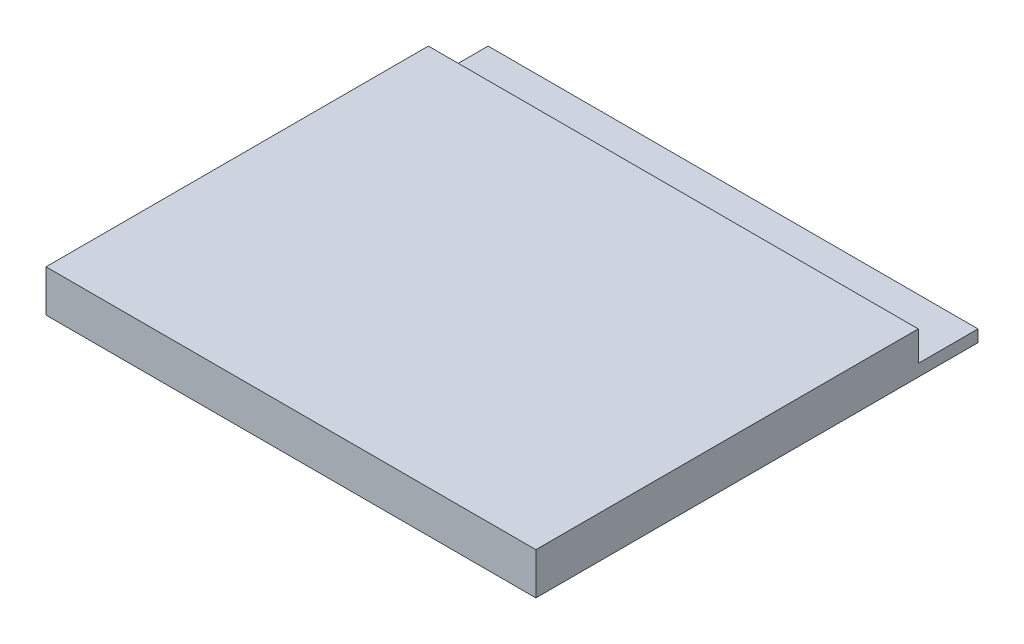
ISO-10303-21;
HEADER;
FILE_DESCRIPTION(('STEP AP214'),'2;1');
FILE_NAME('part.step','',(''),(''),'','','');
FILE_SCHEMA(('AUTOMOTIVE_DESIGN { 1 0 10303 214 1 1 1 1 }'));
ENDSEC;
DATA;
#1=APPLICATION_CONTEXT('core data for automotive mechanical design processes');
#2=APPLICATION_PROTOCOL_DEFINITION('international standard','automotive_design',2000,#1);
#3=PRODUCT_CONTEXT('',#1,'mechanical');
#4=PRODUCT('Part','Part','',(#3));
#5=PRODUCT_RELATED_PRODUCT_CATEGORY('part','',(#4));
#6=PRODUCT_DEFINITION_FORMATION('','',#4);
#7=PRODUCT_DEFINITION_CONTEXT('part definition',#1,'design');
#8=PRODUCT_DEFINITION('design','',#6,#7);
#9=PRODUCT_DEFINITION_SHAPE('','',#8);
#10=(LENGTH_UNIT() NAMED_UNIT(*) SI_UNIT(.MILLI.,.METRE.));
#11=(NAMED_UNIT(*) PLANE_ANGLE_UNIT() SI_UNIT($,.RADIAN.));
#12=(NAMED_UNIT(*) SI_UNIT($,.STERADIAN.) SOLID_ANGLE_UNIT());
#13=UNCERTAINTY_MEASURE_WITH_UNIT(LENGTH_MEASURE(1.E-05),#10,'distance_accuracy_value','');
#14=(GEOMETRIC_REPRESENTATION_CONTEXT(3) GLOBAL_UNCERTAINTY_ASSIGNED_CONTEXT((#13)) GLOBAL_UNIT_ASSIGNED_CONTEXT((#10,
#11,#12)) REPRESENTATION_CONTEXT('',''));
#15=CARTESIAN_POINT('',(0.,0.,0.));
#16=DIRECTION('',(0.,0.,1.));
#17=DIRECTION('',(1.,0.,0.));
#18=AXIS2_PLACEMENT_3D('',#15,#16,#17);
#19=CARTESIAN_POINT('',(41.,3.5,0.));
#20=DIRECTION('',(1.,0.,0.));
#21=DIRECTION('',(0.,0.,-1.));
#22=AXIS2_PLACEMENT_3D('',#19,#20,#21);
#23=PLANE('',#22);
#24=DIRECTION('',(0.,0.,1.));
#25=VECTOR('',#24,1.);
#26=CARTESIAN_POINT('',(41.,0.,0.));
#27=LINE('',#26,#25);
#28=CARTESIAN_POINT('',(41.,0.,-37.));
#29=VERTEX_POINT('',#28);
#30=CARTESIAN_POINT('',(41.,0.,0.));
#31=VERTEX_POINT('',#30);
#32=EDGE_CURVE('E96',#29,#31,#27,.T.);
#33=ORIENTED_EDGE('',*,*,#32,.F.);
#34=DIRECTION('',(0.,-1.,0.));
#35=VECTOR('',#34,1.);
#36=CARTESIAN_POINT('',(41.,1.,-37.));
#37=LINE('',#36,#35);
#38=CARTESIAN_POINT('',(41.,1.,-37.));
#39=VERTEX_POINT('',#38);
#40=EDGE_CURVE('E92',#39,#29,#37,.T.);
#41=ORIENTED_EDGE('',*,*,#40,.F.);
#42=DIRECTION('',(0.,0.,1.));
#43=VECTOR('',#42,1.);
#44=CARTESIAN_POINT('',(41.,1.,0.));
#45=LINE('',#44,#43);
#46=CARTESIAN_POINT('',(41.,1.,-32.));
#47=VERTEX_POINT('',#46);
#48=EDGE_CURVE('E94',#39,#47,#45,.T.);
#49=ORIENTED_EDGE('',*,*,#48,.T.);
#50=DIRECTION('',(0.,-1.,0.));
#51=VECTOR('',#50,1.);
#52=CARTESIAN_POINT('',(41.,3.5,-32.));
#53=LINE('',#52,#51);
#54=CARTESIAN_POINT('',(41.,3.5,-32.));
#55=VERTEX_POINT('',#54);
#56=EDGE_CURVE('E11',#55,#47,#53,.T.);
#57=ORIENTED_EDGE('',*,*,#56,.F.);
#58=DIRECTION('',(0.,0.,1.));
#59=VECTOR('',#58,1.);
#60=CARTESIAN_POINT('',(41.,3.5,0.));
#61=LINE('',#60,#59);
#62=CARTESIAN_POINT('',(41.,3.5,0.));
#63=VERTEX_POINT('',#62);
#64=EDGE_CURVE('E134',#55,#63,#61,.T.);
#65=ORIENTED_EDGE('',*,*,#64,.T.);
#66=DIRECTION('',(0.,-1.,0.));
#67=VECTOR('',#66,1.);
#68=CARTESIAN_POINT('',(41.,3.5,0.));
#69=LINE('',#68,#67);
#70=EDGE_CURVE('E74',#63,#31,#69,.T.);
#71=ORIENTED_EDGE('',*,*,#70,.T.);
#72=EDGE_LOOP('',(#33,#41,#49,#57,#65,#71));
#73=FACE_BOUND('',#72,.T.);
#74=ADVANCED_FACE('F35',(#73),#23,.T.);
#75=CARTESIAN_POINT('',(0.,3.5,-32.));
#76=DIRECTION('',(0.,0.,-1.));
#77=DIRECTION('',(-1.,0.,0.));
#78=AXIS2_PLACEMENT_3D('',#75,#76,#77);
#79=PLANE('',#78);
#80=DIRECTION('',(1.,0.,0.));
#81=VECTOR('',#80,1.);
#82=CARTESIAN_POINT('',(0.,1.,-32.));
#83=LINE('',#82,#81);
#84=CARTESIAN_POINT('',(0.,1.,-32.));
#85=VERTEX_POINT('',#84);
#86=EDGE_CURVE('E50',#85,#47,#83,.T.);
#87=ORIENTED_EDGE('',*,*,#86,.F.);
#88=DIRECTION('',(0.,-1.,0.));
#89=VECTOR('',#88,1.);
#90=CARTESIAN_POINT('',(0.,3.5,-32.));
#91=LINE('',#90,#89);
#92=CARTESIAN_POINT('',(0.,3.5,-32.));
#93=VERTEX_POINT('',#92);
#94=EDGE_CURVE('E43',#93,#85,#91,.T.);
#95=ORIENTED_EDGE('',*,*,#94,.F.);
#96=DIRECTION('',(1.,0.,0.));
#97=VECTOR('',#96,1.);
#98=CARTESIAN_POINT('',(0.,3.5,-32.));
#99=LINE('',#98,#97);
#100=EDGE_CURVE('E141',#93,#55,#99,.T.);
#101=ORIENTED_EDGE('',*,*,#100,.T.);
#102=ORIENTED_EDGE('',*,*,#56,.T.);
#103=EDGE_LOOP('',(#87,#95,#101,#102));
#104=FACE_BOUND('',#103,.T.);
#105=ADVANCED_FACE('F155',(#104),#79,.T.);
#106=CARTESIAN_POINT('',(0.,3.5,0.));
#107=DIRECTION('',(1.,0.,0.));
#108=DIRECTION('',(0.,0.,-1.));
#109=AXIS2_PLACEMENT_3D('',#106,#107,#108);
#110=PLANE('',#109);
#111=DIRECTION('',(0.,0.,1.));
#112=VECTOR('',#111,1.);
#113=CARTESIAN_POINT('',(0.,0.,0.));
#114=LINE('',#113,#112);
#115=CARTESIAN_POINT('',(0.,0.,-37.));
#116=VERTEX_POINT('',#115);
#117=CARTESIAN_POINT('',(0.,0.,0.));
#118=VERTEX_POINT('',#117);
#119=EDGE_CURVE('E135',#116,#118,#114,.T.);
#120=ORIENTED_EDGE('',*,*,#119,.T.);
#121=DIRECTION('',(0.,-1.,0.));
#122=VECTOR('',#121,1.);
#123=CARTESIAN_POINT('',(0.,3.5,0.));
#124=LINE('',#123,#122);
#125=CARTESIAN_POINT('',(0.,3.5,0.));
#126=VERTEX_POINT('',#125);
#127=EDGE_CURVE('E128',#126,#118,#124,.T.);
#128=ORIENTED_EDGE('',*,*,#127,.F.);
#129=DIRECTION('',(0.,0.,1.));
#130=VECTOR('',#129,1.);
#131=CARTESIAN_POINT('',(0.,3.5,0.));
#132=LINE('',#131,#130);
#133=EDGE_CURVE('E139',#93,#126,#132,.T.);
#134=ORIENTED_EDGE('',*,*,#133,.F.);
#135=ORIENTED_EDGE('',*,*,#94,.T.);
#136=DIRECTION('',(0.,0.,1.));
#137=VECTOR('',#136,1.);
#138=CARTESIAN_POINT('',(0.,1.,0.));
#139=LINE('',#138,#137);
#140=CARTESIAN_POINT('',(0.,1.,-37.));
#141=VERTEX_POINT('',#140);
#142=EDGE_CURVE('E113',#141,#85,#139,.T.);
#143=ORIENTED_EDGE('',*,*,#142,.F.);
#144=DIRECTION('',(0.,-1.,0.));
#145=VECTOR('',#144,1.);
#146=CARTESIAN_POINT('',(0.,1.,-37.));
#147=LINE('',#146,#145);
#148=EDGE_CURVE('E101',#141,#116,#147,.T.);
#149=ORIENTED_EDGE('',*,*,#148,.T.);
#150=EDGE_LOOP('',(#120,#128,#134,#135,#143,#149));
#151=FACE_BOUND('',#150,.T.);
#152=ADVANCED_FACE('F145',(#151),#110,.F.);
#153=CARTESIAN_POINT('',(0.,3.5,0.));
#154=DIRECTION('',(0.,0.,-1.));
#155=DIRECTION('',(-1.,0.,0.));
#156=AXIS2_PLACEMENT_3D('',#153,#154,#155);
#157=PLANE('',#156);
#158=DIRECTION('',(1.,0.,0.));
#159=VECTOR('',#158,1.);
#160=CARTESIAN_POINT('',(0.,0.,0.));
#161=LINE('',#160,#159);
#162=EDGE_CURVE('E132',#118,#31,#161,.T.);
#163=ORIENTED_EDGE('',*,*,#162,.T.);
#164=ORIENTED_EDGE('',*,*,#70,.F.);
#165=DIRECTION('',(1.,0.,0.));
#166=VECTOR('',#165,1.);
#167=CARTESIAN_POINT('',(0.,3.5,0.));
#168=LINE('',#167,#166);
#169=EDGE_CURVE('E59',#126,#63,#168,.T.);
#170=ORIENTED_EDGE('',*,*,#169,.F.);
#171=ORIENTED_EDGE('',*,*,#127,.T.);
#172=EDGE_LOOP('',(#163,#164,#170,#171));
#173=FACE_BOUND('',#172,.T.);
#174=ADVANCED_FACE('F151',(#173),#157,.F.);
#175=CARTESIAN_POINT('',(0.,3.5,0.));
#176=DIRECTION('',(0.,1.,0.));
#177=DIRECTION('',(0.,0.,1.));
#178=AXIS2_PLACEMENT_3D('',#175,#176,#177);
#179=PLANE('',#178);
#180=ORIENTED_EDGE('',*,*,#64,.F.);
#181=ORIENTED_EDGE('',*,*,#100,.F.);
#182=ORIENTED_EDGE('',*,*,#133,.T.);
#183=ORIENTED_EDGE('',*,*,#169,.T.);
#184=EDGE_LOOP('',(#180,#181,#182,#183));
#185=FACE_BOUND('',#184,.T.);
#186=ADVANCED_FACE('F154',(#185),#179,.T.);
#187=CARTESIAN_POINT('',(0.,0.,0.));
#188=DIRECTION('',(0.,1.,0.));
#189=DIRECTION('',(0.,0.,1.));
#190=AXIS2_PLACEMENT_3D('',#187,#188,#189);
#191=PLANE('',#190);
#192=ORIENTED_EDGE('',*,*,#32,.T.);
#193=ORIENTED_EDGE('',*,*,#162,.F.);
#194=ORIENTED_EDGE('',*,*,#119,.F.);
#195=DIRECTION('',(1.,0.,0.));
#196=VECTOR('',#195,1.);
#197=CARTESIAN_POINT('',(0.,0.,-37.));
#198=LINE('',#197,#196);
#199=EDGE_CURVE('E108',#116,#29,#198,.T.);
#200=ORIENTED_EDGE('',*,*,#199,.T.);
#201=EDGE_LOOP('',(#192,#193,#194,#200));
#202=FACE_BOUND('',#201,.T.);
#203=ADVANCED_FACE('F148',(#202),#191,.F.);
#204=CARTESIAN_POINT('',(0.,1.,-37.));
#205=DIRECTION('',(0.,0.,-1.));
#206=DIRECTION('',(-1.,0.,0.));
#207=AXIS2_PLACEMENT_3D('',#204,#205,#206);
#208=PLANE('',#207);
#209=ORIENTED_EDGE('',*,*,#199,.F.);
#210=ORIENTED_EDGE('',*,*,#148,.F.);
#211=DIRECTION('',(1.,0.,0.));
#212=VECTOR('',#211,1.);
#213=CARTESIAN_POINT('',(0.,1.,-37.));
#214=LINE('',#213,#212);
#215=EDGE_CURVE('E107',#141,#39,#214,.T.);
#216=ORIENTED_EDGE('',*,*,#215,.T.);
#217=ORIENTED_EDGE('',*,*,#40,.T.);
#218=EDGE_LOOP('',(#209,#210,#216,#217));
#219=FACE_BOUND('',#218,.T.);
#220=ADVANCED_FACE('F110',(#219),#208,.T.);
#221=CARTESIAN_POINT('',(0.,1.,0.));
#222=DIRECTION('',(0.,1.,0.));
#223=DIRECTION('',(0.,0.,1.));
#224=AXIS2_PLACEMENT_3D('',#221,#222,#223);
#225=PLANE('',#224);
#226=ORIENTED_EDGE('',*,*,#48,.F.);
#227=ORIENTED_EDGE('',*,*,#215,.F.);
#228=ORIENTED_EDGE('',*,*,#142,.T.);
#229=ORIENTED_EDGE('',*,*,#86,.T.);
#230=EDGE_LOOP('',(#226,#227,#228,#229));
#231=FACE_BOUND('',#230,.T.);
#232=ADVANCED_FACE('F105',(#231),#225,.T.);
#233=CLOSED_SHELL('',(#74,#105,#152,#174,#186,#203,#220,#232));
#234=MANIFOLD_SOLID_BREP('B2',#233);
#235=ADVANCED_BREP_SHAPE_REPRESENTATION('',(#18,#234),#14);
#236=SHAPE_DEFINITION_REPRESENTATION(#9,#235);
ENDSEC;
END-ISO-10303-21;
